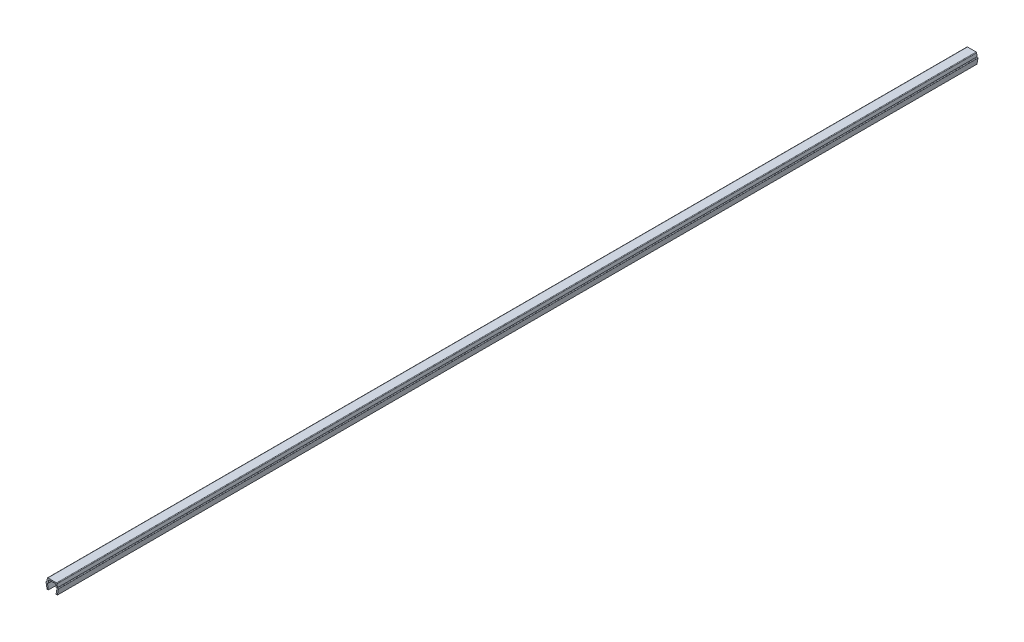
ISO-10303-21;
HEADER;
FILE_DESCRIPTION(('STEP AP214'),'2;1');
FILE_NAME('part.step','',(''),(''),'','','');
FILE_SCHEMA(('AUTOMOTIVE_DESIGN { 1 0 10303 214 1 1 1 1 }'));
ENDSEC;
DATA;
#1=APPLICATION_CONTEXT('core data for automotive mechanical design processes');
#2=APPLICATION_PROTOCOL_DEFINITION('international standard','automotive_design',2000,#1);
#3=PRODUCT_CONTEXT('',#1,'mechanical');
#4=PRODUCT('Part','Part','',(#3));
#5=PRODUCT_RELATED_PRODUCT_CATEGORY('part','',(#4));
#6=PRODUCT_DEFINITION_FORMATION('','',#4);
#7=PRODUCT_DEFINITION_CONTEXT('part definition',#1,'design');
#8=PRODUCT_DEFINITION('design','',#6,#7);
#9=PRODUCT_DEFINITION_SHAPE('','',#8);
#10=(LENGTH_UNIT() NAMED_UNIT(*) SI_UNIT(.MILLI.,.METRE.));
#11=(NAMED_UNIT(*) PLANE_ANGLE_UNIT() SI_UNIT($,.RADIAN.));
#12=(NAMED_UNIT(*) SI_UNIT($,.STERADIAN.) SOLID_ANGLE_UNIT());
#13=UNCERTAINTY_MEASURE_WITH_UNIT(LENGTH_MEASURE(1.E-05),#10,'distance_accuracy_value','');
#14=(GEOMETRIC_REPRESENTATION_CONTEXT(3) GLOBAL_UNCERTAINTY_ASSIGNED_CONTEXT((#13)) GLOBAL_UNIT_ASSIGNED_CONTEXT((#10,
#11,#12)) REPRESENTATION_CONTEXT('',''));
#15=CARTESIAN_POINT('',(0.,0.,0.));
#16=DIRECTION('',(0.,0.,1.));
#17=DIRECTION('',(1.,0.,0.));
#18=AXIS2_PLACEMENT_3D('',#15,#16,#17);
#19=CARTESIAN_POINT('',(-3.25000000000003,3.35000000000003,266.75));
#20=DIRECTION('',(0.,0.,-1.));
#21=DIRECTION('',(-1.,0.,0.));
#22=AXIS2_PLACEMENT_3D('',#19,#20,#21);
#23=CYLINDRICAL_SURFACE('',#22,0.349999999999972);
#24=DIRECTION('',(0.,0.,-1.));
#25=VECTOR('',#24,1.);
#26=CARTESIAN_POINT('',(-3.25,3.7,266.75));
#27=LINE('',#26,#25);
#28=CARTESIAN_POINT('',(-3.25,3.7,266.75));
#29=VERTEX_POINT('',#28);
#30=CARTESIAN_POINT('',(-3.25,3.7,-266.75));
#31=VERTEX_POINT('',#30);
#32=EDGE_CURVE('E211',#29,#31,#27,.T.);
#33=ORIENTED_EDGE('',*,*,#32,.T.);
#34=CARTESIAN_POINT('',(-3.25000000000003,3.35000000000003,-266.75));
#35=DIRECTION('',(0.,0.,1.));
#36=DIRECTION('',(1.,0.,0.));
#37=AXIS2_PLACEMENT_3D('',#34,#35,#36);
#38=CIRCLE('',#37,0.349999999999972);
#39=CARTESIAN_POINT('',(-3.6,3.35,-266.75));
#40=VERTEX_POINT('',#39);
#41=EDGE_CURVE('E205',#31,#40,#38,.T.);
#42=ORIENTED_EDGE('',*,*,#41,.T.);
#43=DIRECTION('',(0.,0.,-1.));
#44=VECTOR('',#43,1.);
#45=CARTESIAN_POINT('',(-3.6,3.35,266.75));
#46=LINE('',#45,#44);
#47=CARTESIAN_POINT('',(-3.6,3.35,266.75));
#48=VERTEX_POINT('',#47);
#49=EDGE_CURVE('E11',#48,#40,#46,.T.);
#50=ORIENTED_EDGE('',*,*,#49,.F.);
#51=CARTESIAN_POINT('',(-3.25000000000003,3.35000000000003,266.75));
#52=DIRECTION('',(0.,0.,1.));
#53=DIRECTION('',(1.,0.,0.));
#54=AXIS2_PLACEMENT_3D('',#51,#52,#53);
#55=CIRCLE('',#54,0.349999999999972);
#56=EDGE_CURVE('E277',#29,#48,#55,.T.);
#57=ORIENTED_EDGE('',*,*,#56,.F.);
#58=EDGE_LOOP('',(#33,#42,#50,#57));
#59=FACE_BOUND('',#58,.T.);
#60=ADVANCED_FACE('F33',(#59),#23,.T.);
#61=CARTESIAN_POINT('',(-3.6,3.35,266.75));
#62=DIRECTION('',(0.984336643247304,0.176299100283099,0.));
#63=DIRECTION('',(-0.176299100283099,0.984336643247304,0.));
#64=AXIS2_PLACEMENT_3D('',#61,#62,#63);
#65=PLANE('',#64);
#66=ORIENTED_EDGE('',*,*,#49,.T.);
#67=DIRECTION('',(0.176299100283099,-0.984336643247304,0.));
#68=VECTOR('',#67,1.);
#69=CARTESIAN_POINT('',(-3.6,3.35,-266.75));
#70=LINE('',#69,#68);
#71=CARTESIAN_POINT('',(-3.,0.,-266.75));
#72=VERTEX_POINT('',#71);
#73=EDGE_CURVE('E195',#40,#72,#70,.T.);
#74=ORIENTED_EDGE('',*,*,#73,.T.);
#75=DIRECTION('',(0.,0.,-1.));
#76=VECTOR('',#75,1.);
#77=CARTESIAN_POINT('',(-3.,0.,266.75));
#78=LINE('',#77,#76);
#79=CARTESIAN_POINT('',(-3.,0.,266.75));
#80=VERTEX_POINT('',#79);
#81=EDGE_CURVE('E40',#80,#72,#78,.T.);
#82=ORIENTED_EDGE('',*,*,#81,.F.);
#83=DIRECTION('',(0.176299100283099,-0.984336643247304,0.));
#84=VECTOR('',#83,1.);
#85=CARTESIAN_POINT('',(-3.6,3.35,266.75));
#86=LINE('',#85,#84);
#87=EDGE_CURVE('E196',#48,#80,#86,.T.);
#88=ORIENTED_EDGE('',*,*,#87,.F.);
#89=EDGE_LOOP('',(#66,#74,#82,#88));
#90=FACE_BOUND('',#89,.T.);
#91=ADVANCED_FACE('F193',(#90),#65,.F.);
#92=CARTESIAN_POINT('',(-3.,0.,266.75));
#93=DIRECTION('',(0.,1.,0.));
#94=DIRECTION('',(0.,0.,1.));
#95=AXIS2_PLACEMENT_3D('',#92,#93,#94);
#96=PLANE('',#95);
#97=ORIENTED_EDGE('',*,*,#81,.T.);
#98=DIRECTION('',(1.,0.,0.));
#99=VECTOR('',#98,1.);
#100=CARTESIAN_POINT('',(-3.,0.,-266.75));
#101=LINE('',#100,#99);
#102=CARTESIAN_POINT('',(-2.2,0.,-266.75));
#103=VERTEX_POINT('',#102);
#104=EDGE_CURVE('E209',#72,#103,#101,.T.);
#105=ORIENTED_EDGE('',*,*,#104,.T.);
#106=DIRECTION('',(0.,0.,-1.));
#107=VECTOR('',#106,1.);
#108=CARTESIAN_POINT('',(-2.2,0.,266.75));
#109=LINE('',#108,#107);
#110=CARTESIAN_POINT('',(-2.2,0.,266.75));
#111=VERTEX_POINT('',#110);
#112=EDGE_CURVE('E363',#111,#103,#109,.T.);
#113=ORIENTED_EDGE('',*,*,#112,.F.);
#114=DIRECTION('',(1.,0.,0.));
#115=VECTOR('',#114,1.);
#116=CARTESIAN_POINT('',(-3.,0.,266.75));
#117=LINE('',#116,#115);
#118=EDGE_CURVE('E280',#80,#111,#117,.T.);
#119=ORIENTED_EDGE('',*,*,#118,.F.);
#120=EDGE_LOOP('',(#97,#105,#113,#119));
#121=FACE_BOUND('',#120,.T.);
#122=ADVANCED_FACE('F366',(#121),#96,.F.);
#123=CARTESIAN_POINT('',(-2.2,0.,266.75));
#124=DIRECTION('',(-0.984336643247306,-0.176299100283088,0.));
#125=DIRECTION('',(0.176299100283088,-0.984336643247306,0.));
#126=AXIS2_PLACEMENT_3D('',#123,#124,#125);
#127=PLANE('',#126);
#128=ORIENTED_EDGE('',*,*,#112,.T.);
#129=DIRECTION('',(-0.176299100283088,0.984336643247306,0.));
#130=VECTOR('',#129,1.);
#131=CARTESIAN_POINT('',(-2.2,0.,-266.75));
#132=LINE('',#131,#130);
#133=CARTESIAN_POINT('',(-2.7352170713255,2.9882953149009,-266.75));
#134=VERTEX_POINT('',#133);
#135=EDGE_CURVE('E215',#103,#134,#132,.T.);
#136=ORIENTED_EDGE('',*,*,#135,.T.);
#137=DIRECTION('',(0.,0.,-1.));
#138=VECTOR('',#137,1.);
#139=CARTESIAN_POINT('',(-2.7352170713255,2.9882953149009,266.75));
#140=LINE('',#139,#138);
#141=CARTESIAN_POINT('',(-2.7352170713255,2.9882953149009,266.75));
#142=VERTEX_POINT('',#141);
#143=EDGE_CURVE('E361',#142,#134,#140,.T.);
#144=ORIENTED_EDGE('',*,*,#143,.F.);
#145=DIRECTION('',(-0.176299100283088,0.984336643247306,0.));
#146=VECTOR('',#145,1.);
#147=CARTESIAN_POINT('',(-2.2,0.,266.75));
#148=LINE('',#147,#146);
#149=EDGE_CURVE('E282',#111,#142,#148,.T.);
#150=ORIENTED_EDGE('',*,*,#149,.F.);
#151=EDGE_LOOP('',(#128,#136,#144,#150));
#152=FACE_BOUND('',#151,.T.);
#153=ADVANCED_FACE('F374',(#152),#127,.F.);
#154=CARTESIAN_POINT('',(-2.390699246189,3.05000000000004,266.75));
#155=DIRECTION('',(0.,0.,-1.));
#156=DIRECTION('',(-1.,0.,0.));
#157=AXIS2_PLACEMENT_3D('',#154,#155,#156);
#158=CYLINDRICAL_SURFACE('',#157,0.349999999999955);
#159=ORIENTED_EDGE('',*,*,#143,.T.);
#160=CARTESIAN_POINT('',(-2.390699246189,3.05000000000004,-266.75));
#161=DIRECTION('',(0.,0.,-1.));
#162=DIRECTION('',(-1.,0.,0.));
#163=AXIS2_PLACEMENT_3D('',#160,#161,#162);
#164=CIRCLE('',#163,0.349999999999955);
#165=CARTESIAN_POINT('',(-2.390699246189,3.4,-266.75));
#166=VERTEX_POINT('',#165);
#167=EDGE_CURVE('E218',#134,#166,#164,.T.);
#168=ORIENTED_EDGE('',*,*,#167,.T.);
#169=DIRECTION('',(0.,0.,-1.));
#170=VECTOR('',#169,1.);
#171=CARTESIAN_POINT('',(-2.390699246189,3.4,266.75));
#172=LINE('',#171,#170);
#173=CARTESIAN_POINT('',(-2.390699246189,3.4,266.75));
#174=VERTEX_POINT('',#173);
#175=EDGE_CURVE('E359',#174,#166,#172,.T.);
#176=ORIENTED_EDGE('',*,*,#175,.F.);
#177=CARTESIAN_POINT('',(-2.390699246189,3.05000000000004,266.75));
#178=DIRECTION('',(0.,0.,-1.));
#179=DIRECTION('',(-1.,0.,0.));
#180=AXIS2_PLACEMENT_3D('',#177,#178,#179);
#181=CIRCLE('',#180,0.349999999999955);
#182=EDGE_CURVE('E284',#142,#174,#181,.T.);
#183=ORIENTED_EDGE('',*,*,#182,.F.);
#184=EDGE_LOOP('',(#159,#168,#176,#183));
#185=FACE_BOUND('',#184,.T.);
#186=ADVANCED_FACE('F377',(#185),#158,.F.);
#187=CARTESIAN_POINT('',(-2.390699246189,3.4,266.75));
#188=DIRECTION('',(0.,1.,0.));
#189=DIRECTION('',(0.,0.,1.));
#190=AXIS2_PLACEMENT_3D('',#187,#188,#189);
#191=PLANE('',#190);
#192=ORIENTED_EDGE('',*,*,#175,.T.);
#193=DIRECTION('',(1.,0.,0.));
#194=VECTOR('',#193,1.);
#195=CARTESIAN_POINT('',(-2.390699246189,3.4,-266.75));
#196=LINE('',#195,#194);
#197=CARTESIAN_POINT('',(-2.2,3.4,-266.75));
#198=VERTEX_POINT('',#197);
#199=EDGE_CURVE('E221',#166,#198,#196,.T.);
#200=ORIENTED_EDGE('',*,*,#199,.T.);
#201=DIRECTION('',(0.,0.,-1.));
#202=VECTOR('',#201,1.);
#203=CARTESIAN_POINT('',(-2.2,3.4,266.75));
#204=LINE('',#203,#202);
#205=CARTESIAN_POINT('',(-2.2,3.4,266.75));
#206=VERTEX_POINT('',#205);
#207=EDGE_CURVE('E357',#206,#198,#204,.T.);
#208=ORIENTED_EDGE('',*,*,#207,.F.);
#209=DIRECTION('',(1.,0.,0.));
#210=VECTOR('',#209,1.);
#211=CARTESIAN_POINT('',(-2.390699246189,3.4,266.75));
#212=LINE('',#211,#210);
#213=EDGE_CURVE('E286',#174,#206,#212,.T.);
#214=ORIENTED_EDGE('',*,*,#213,.F.);
#215=EDGE_LOOP('',(#192,#200,#208,#214));
#216=FACE_BOUND('',#215,.T.);
#217=ADVANCED_FACE('F382',(#216),#191,.F.);
#218=CARTESIAN_POINT('',(-2.2,3.4,266.75));
#219=DIRECTION('',(-0.996194698091743,0.08715574274769,0.));
#220=DIRECTION('',(-0.08715574274769,-0.996194698091743,0.));
#221=AXIS2_PLACEMENT_3D('',#218,#219,#220);
#222=PLANE('',#221);
#223=ORIENTED_EDGE('',*,*,#207,.T.);
#224=DIRECTION('',(0.08715574274769,0.996194698091743,0.));
#225=VECTOR('',#224,1.);
#226=CARTESIAN_POINT('',(-2.2,3.4,-266.75));
#227=LINE('',#226,#225);
#228=CARTESIAN_POINT('',(-2.0704726390793,4.8805045099617,-266.75));
#229=VERTEX_POINT('',#228);
#230=EDGE_CURVE('E224',#198,#229,#227,.T.);
#231=ORIENTED_EDGE('',*,*,#230,.T.);
#232=DIRECTION('',(0.,0.,-1.));
#233=VECTOR('',#232,1.);
#234=CARTESIAN_POINT('',(-2.0704726390793,4.8805045099617,266.75));
#235=LINE('',#234,#233);
#236=CARTESIAN_POINT('',(-2.0704726390793,4.8805045099617,266.75));
#237=VERTEX_POINT('',#236);
#238=EDGE_CURVE('E355',#237,#229,#235,.T.);
#239=ORIENTED_EDGE('',*,*,#238,.F.);
#240=DIRECTION('',(0.08715574274769,0.996194698091743,0.));
#241=VECTOR('',#240,1.);
#242=CARTESIAN_POINT('',(-2.2,3.4,266.75));
#243=LINE('',#242,#241);
#244=EDGE_CURVE('E288',#206,#237,#243,.T.);
#245=ORIENTED_EDGE('',*,*,#244,.F.);
#246=EDGE_LOOP('',(#223,#231,#239,#245));
#247=FACE_BOUND('',#246,.T.);
#248=ADVANCED_FACE('F388',(#247),#222,.F.);
#249=CARTESIAN_POINT('',(-1.72180449474716,4.84999999999996,266.75));
#250=DIRECTION('',(0.,0.,-1.));
#251=DIRECTION('',(-1.,0.,0.));
#252=AXIS2_PLACEMENT_3D('',#249,#250,#251);
#253=CYLINDRICAL_SURFACE('',#252,0.350000000000036);
#254=ORIENTED_EDGE('',*,*,#238,.T.);
#255=CARTESIAN_POINT('',(-1.72180449474716,4.84999999999996,-266.75));
#256=DIRECTION('',(0.,0.,-1.));
#257=DIRECTION('',(-1.,0.,0.));
#258=AXIS2_PLACEMENT_3D('',#255,#256,#257);
#259=CIRCLE('',#258,0.350000000000036);
#260=CARTESIAN_POINT('',(-1.7218044947472,5.2,-266.75));
#261=VERTEX_POINT('',#260);
#262=EDGE_CURVE('E227',#229,#261,#259,.T.);
#263=ORIENTED_EDGE('',*,*,#262,.T.);
#264=DIRECTION('',(0.,0.,-1.));
#265=VECTOR('',#264,1.);
#266=CARTESIAN_POINT('',(-1.7218044947472,5.2,266.75));
#267=LINE('',#266,#265);
#268=CARTESIAN_POINT('',(-1.7218044947472,5.2,266.75));
#269=VERTEX_POINT('',#268);
#270=EDGE_CURVE('E353',#269,#261,#267,.T.);
#271=ORIENTED_EDGE('',*,*,#270,.F.);
#272=CARTESIAN_POINT('',(-1.72180449474716,4.84999999999996,266.75));
#273=DIRECTION('',(0.,0.,-1.));
#274=DIRECTION('',(-1.,0.,0.));
#275=AXIS2_PLACEMENT_3D('',#272,#273,#274);
#276=CIRCLE('',#275,0.350000000000036);
#277=EDGE_CURVE('E290',#237,#269,#276,.T.);
#278=ORIENTED_EDGE('',*,*,#277,.F.);
#279=EDGE_LOOP('',(#254,#263,#271,#278));
#280=FACE_BOUND('',#279,.T.);
#281=ADVANCED_FACE('F392',(#280),#253,.F.);
#282=CARTESIAN_POINT('',(-1.7218044947472,5.2,266.75));
#283=DIRECTION('',(0.,1.,0.));
#284=DIRECTION('',(0.,0.,1.));
#285=AXIS2_PLACEMENT_3D('',#282,#283,#284);
#286=PLANE('',#285);
#287=ORIENTED_EDGE('',*,*,#270,.T.);
#288=DIRECTION('',(1.,0.,0.));
#289=VECTOR('',#288,1.);
#290=CARTESIAN_POINT('',(-1.7218044947472,5.2,-266.75));
#291=LINE('',#290,#289);
#292=CARTESIAN_POINT('',(1.7218044947472,5.2,-266.75));
#293=VERTEX_POINT('',#292);
#294=EDGE_CURVE('E230',#261,#293,#291,.T.);
#295=ORIENTED_EDGE('',*,*,#294,.T.);
#296=DIRECTION('',(0.,0.,-1.));
#297=VECTOR('',#296,1.);
#298=CARTESIAN_POINT('',(1.7218044947472,5.2,266.75));
#299=LINE('',#298,#297);
#300=CARTESIAN_POINT('',(1.7218044947472,5.2,266.75));
#301=VERTEX_POINT('',#300);
#302=EDGE_CURVE('E351',#301,#293,#299,.T.);
#303=ORIENTED_EDGE('',*,*,#302,.F.);
#304=DIRECTION('',(1.,0.,0.));
#305=VECTOR('',#304,1.);
#306=CARTESIAN_POINT('',(-1.7218044947472,5.2,266.75));
#307=LINE('',#306,#305);
#308=EDGE_CURVE('E292',#269,#301,#307,.T.);
#309=ORIENTED_EDGE('',*,*,#308,.F.);
#310=EDGE_LOOP('',(#287,#295,#303,#309));
#311=FACE_BOUND('',#310,.T.);
#312=ADVANCED_FACE('F397',(#311),#286,.F.);
#313=CARTESIAN_POINT('',(1.72180449474716,4.84999999999996,266.75));
#314=DIRECTION('',(0.,0.,-1.));
#315=DIRECTION('',(-1.,0.,0.));
#316=AXIS2_PLACEMENT_3D('',#313,#314,#315);
#317=CYLINDRICAL_SURFACE('',#316,0.350000000000036);
#318=ORIENTED_EDGE('',*,*,#302,.T.);
#319=CARTESIAN_POINT('',(1.72180449474716,4.84999999999996,-266.75));
#320=DIRECTION('',(0.,0.,-1.));
#321=DIRECTION('',(-1.,0.,0.));
#322=AXIS2_PLACEMENT_3D('',#319,#320,#321);
#323=CIRCLE('',#322,0.350000000000036);
#324=CARTESIAN_POINT('',(2.0704726390793,4.8805045099617,-266.75));
#325=VERTEX_POINT('',#324);
#326=EDGE_CURVE('E233',#293,#325,#323,.T.);
#327=ORIENTED_EDGE('',*,*,#326,.T.);
#328=DIRECTION('',(0.,0.,-1.));
#329=VECTOR('',#328,1.);
#330=CARTESIAN_POINT('',(2.0704726390793,4.8805045099617,266.75));
#331=LINE('',#330,#329);
#332=CARTESIAN_POINT('',(2.0704726390793,4.8805045099617,266.75));
#333=VERTEX_POINT('',#332);
#334=EDGE_CURVE('E349',#333,#325,#331,.T.);
#335=ORIENTED_EDGE('',*,*,#334,.F.);
#336=CARTESIAN_POINT('',(1.72180449474716,4.84999999999996,266.75));
#337=DIRECTION('',(0.,0.,-1.));
#338=DIRECTION('',(-1.,0.,0.));
#339=AXIS2_PLACEMENT_3D('',#336,#337,#338);
#340=CIRCLE('',#339,0.350000000000036);
#341=EDGE_CURVE('E294',#301,#333,#340,.T.);
#342=ORIENTED_EDGE('',*,*,#341,.F.);
#343=EDGE_LOOP('',(#318,#327,#335,#342));
#344=FACE_BOUND('',#343,.T.);
#345=ADVANCED_FACE('F403',(#344),#317,.F.);
#346=CARTESIAN_POINT('',(2.0704726390793,4.8805045099617,266.75));
#347=DIRECTION('',(0.996194698091743,0.08715574274769,0.));
#348=DIRECTION('',(-0.08715574274769,0.996194698091743,0.));
#349=AXIS2_PLACEMENT_3D('',#346,#347,#348);
#350=PLANE('',#349);
#351=ORIENTED_EDGE('',*,*,#334,.T.);
#352=DIRECTION('',(0.08715574274769,-0.996194698091743,0.));
#353=VECTOR('',#352,1.);
#354=CARTESIAN_POINT('',(2.0704726390793,4.8805045099617,-266.75));
#355=LINE('',#354,#353);
#356=CARTESIAN_POINT('',(2.2,3.4,-266.75));
#357=VERTEX_POINT('',#356);
#358=EDGE_CURVE('E236',#325,#357,#355,.T.);
#359=ORIENTED_EDGE('',*,*,#358,.T.);
#360=DIRECTION('',(0.,0.,-1.));
#361=VECTOR('',#360,1.);
#362=CARTESIAN_POINT('',(2.2,3.4,266.75));
#363=LINE('',#362,#361);
#364=CARTESIAN_POINT('',(2.2,3.4,266.75));
#365=VERTEX_POINT('',#364);
#366=EDGE_CURVE('E347',#365,#357,#363,.T.);
#367=ORIENTED_EDGE('',*,*,#366,.F.);
#368=DIRECTION('',(0.08715574274769,-0.996194698091743,0.));
#369=VECTOR('',#368,1.);
#370=CARTESIAN_POINT('',(2.0704726390793,4.8805045099617,266.75));
#371=LINE('',#370,#369);
#372=EDGE_CURVE('E296',#333,#365,#371,.T.);
#373=ORIENTED_EDGE('',*,*,#372,.F.);
#374=EDGE_LOOP('',(#351,#359,#367,#373));
#375=FACE_BOUND('',#374,.T.);
#376=ADVANCED_FACE('F407',(#375),#350,.F.);
#377=CARTESIAN_POINT('',(2.2,3.4,266.75));
#378=DIRECTION('',(0.,1.,0.));
#379=DIRECTION('',(0.,0.,1.));
#380=AXIS2_PLACEMENT_3D('',#377,#378,#379);
#381=PLANE('',#380);
#382=ORIENTED_EDGE('',*,*,#366,.T.);
#383=DIRECTION('',(1.,0.,0.));
#384=VECTOR('',#383,1.);
#385=CARTESIAN_POINT('',(2.2,3.4,-266.75));
#386=LINE('',#385,#384);
#387=CARTESIAN_POINT('',(2.390699246189,3.4,-266.75));
#388=VERTEX_POINT('',#387);
#389=EDGE_CURVE('E239',#357,#388,#386,.T.);
#390=ORIENTED_EDGE('',*,*,#389,.T.);
#391=DIRECTION('',(0.,0.,-1.));
#392=VECTOR('',#391,1.);
#393=CARTESIAN_POINT('',(2.390699246189,3.4,266.75));
#394=LINE('',#393,#392);
#395=CARTESIAN_POINT('',(2.390699246189,3.4,266.75));
#396=VERTEX_POINT('',#395);
#397=EDGE_CURVE('E345',#396,#388,#394,.T.);
#398=ORIENTED_EDGE('',*,*,#397,.F.);
#399=DIRECTION('',(1.,0.,0.));
#400=VECTOR('',#399,1.);
#401=CARTESIAN_POINT('',(2.2,3.4,266.75));
#402=LINE('',#401,#400);
#403=EDGE_CURVE('E298',#365,#396,#402,.T.);
#404=ORIENTED_EDGE('',*,*,#403,.F.);
#405=EDGE_LOOP('',(#382,#390,#398,#404));
#406=FACE_BOUND('',#405,.T.);
#407=ADVANCED_FACE('F412',(#406),#381,.F.);
#408=CARTESIAN_POINT('',(2.390699246189,3.05000000000004,266.75));
#409=DIRECTION('',(0.,0.,-1.));
#410=DIRECTION('',(-1.,0.,0.));
#411=AXIS2_PLACEMENT_3D('',#408,#409,#410);
#412=CYLINDRICAL_SURFACE('',#411,0.349999999999955);
#413=ORIENTED_EDGE('',*,*,#397,.T.);
#414=CARTESIAN_POINT('',(2.390699246189,3.05000000000004,-266.75));
#415=DIRECTION('',(0.,0.,-1.));
#416=DIRECTION('',(-1.,0.,0.));
#417=AXIS2_PLACEMENT_3D('',#414,#415,#416);
#418=CIRCLE('',#417,0.349999999999955);
#419=CARTESIAN_POINT('',(2.7352170713255,2.9882953149009,-266.75));
#420=VERTEX_POINT('',#419);
#421=EDGE_CURVE('E242',#388,#420,#418,.T.);
#422=ORIENTED_EDGE('',*,*,#421,.T.);
#423=DIRECTION('',(0.,0.,-1.));
#424=VECTOR('',#423,1.);
#425=CARTESIAN_POINT('',(2.7352170713255,2.9882953149009,266.75));
#426=LINE('',#425,#424);
#427=CARTESIAN_POINT('',(2.7352170713255,2.9882953149009,266.75));
#428=VERTEX_POINT('',#427);
#429=EDGE_CURVE('E343',#428,#420,#426,.T.);
#430=ORIENTED_EDGE('',*,*,#429,.F.);
#431=CARTESIAN_POINT('',(2.390699246189,3.05000000000004,266.75));
#432=DIRECTION('',(0.,0.,-1.));
#433=DIRECTION('',(-1.,0.,0.));
#434=AXIS2_PLACEMENT_3D('',#431,#432,#433);
#435=CIRCLE('',#434,0.349999999999955);
#436=EDGE_CURVE('E300',#396,#428,#435,.T.);
#437=ORIENTED_EDGE('',*,*,#436,.F.);
#438=EDGE_LOOP('',(#413,#422,#430,#437));
#439=FACE_BOUND('',#438,.T.);
#440=ADVANCED_FACE('F418',(#439),#412,.F.);
#441=CARTESIAN_POINT('',(2.7352170713255,2.9882953149009,266.75));
#442=DIRECTION('',(0.984336643247306,-0.176299100283088,0.));
#443=DIRECTION('',(0.176299100283088,0.984336643247306,0.));
#444=AXIS2_PLACEMENT_3D('',#441,#442,#443);
#445=PLANE('',#444);
#446=ORIENTED_EDGE('',*,*,#429,.T.);
#447=DIRECTION('',(-0.176299100283088,-0.984336643247306,0.));
#448=VECTOR('',#447,1.);
#449=CARTESIAN_POINT('',(2.7352170713255,2.9882953149009,-266.75));
#450=LINE('',#449,#448);
#451=CARTESIAN_POINT('',(2.2,0.,-266.75));
#452=VERTEX_POINT('',#451);
#453=EDGE_CURVE('E245',#420,#452,#450,.T.);
#454=ORIENTED_EDGE('',*,*,#453,.T.);
#455=DIRECTION('',(0.,0.,-1.));
#456=VECTOR('',#455,1.);
#457=CARTESIAN_POINT('',(2.2,0.,266.75));
#458=LINE('',#457,#456);
#459=CARTESIAN_POINT('',(2.2,0.,266.75));
#460=VERTEX_POINT('',#459);
#461=EDGE_CURVE('E341',#460,#452,#458,.T.);
#462=ORIENTED_EDGE('',*,*,#461,.F.);
#463=DIRECTION('',(-0.176299100283088,-0.984336643247306,0.));
#464=VECTOR('',#463,1.);
#465=CARTESIAN_POINT('',(2.7352170713255,2.9882953149009,266.75));
#466=LINE('',#465,#464);
#467=EDGE_CURVE('E302',#428,#460,#466,.T.);
#468=ORIENTED_EDGE('',*,*,#467,.F.);
#469=EDGE_LOOP('',(#446,#454,#462,#468));
#470=FACE_BOUND('',#469,.T.);
#471=ADVANCED_FACE('F422',(#470),#445,.F.);
#472=CARTESIAN_POINT('',(2.2,0.,266.75));
#473=DIRECTION('',(0.,1.,0.));
#474=DIRECTION('',(0.,0.,1.));
#475=AXIS2_PLACEMENT_3D('',#472,#473,#474);
#476=PLANE('',#475);
#477=ORIENTED_EDGE('',*,*,#461,.T.);
#478=DIRECTION('',(1.,0.,0.));
#479=VECTOR('',#478,1.);
#480=CARTESIAN_POINT('',(2.2,0.,-266.75));
#481=LINE('',#480,#479);
#482=CARTESIAN_POINT('',(3.,0.,-266.75));
#483=VERTEX_POINT('',#482);
#484=EDGE_CURVE('E248',#452,#483,#481,.T.);
#485=ORIENTED_EDGE('',*,*,#484,.T.);
#486=DIRECTION('',(0.,0.,-1.));
#487=VECTOR('',#486,1.);
#488=CARTESIAN_POINT('',(3.,0.,266.75));
#489=LINE('',#488,#487);
#490=CARTESIAN_POINT('',(3.,0.,266.75));
#491=VERTEX_POINT('',#490);
#492=EDGE_CURVE('E339',#491,#483,#489,.T.);
#493=ORIENTED_EDGE('',*,*,#492,.F.);
#494=DIRECTION('',(1.,0.,0.));
#495=VECTOR('',#494,1.);
#496=CARTESIAN_POINT('',(2.2,0.,266.75));
#497=LINE('',#496,#495);
#498=EDGE_CURVE('E304',#460,#491,#497,.T.);
#499=ORIENTED_EDGE('',*,*,#498,.F.);
#500=EDGE_LOOP('',(#477,#485,#493,#499));
#501=FACE_BOUND('',#500,.T.);
#502=ADVANCED_FACE('F427',(#501),#476,.F.);
#503=CARTESIAN_POINT('',(3.,0.,266.75));
#504=DIRECTION('',(-0.984336643247304,0.176299100283099,0.));
#505=DIRECTION('',(-0.176299100283099,-0.984336643247304,0.));
#506=AXIS2_PLACEMENT_3D('',#503,#504,#505);
#507=PLANE('',#506);
#508=ORIENTED_EDGE('',*,*,#492,.T.);
#509=DIRECTION('',(0.176299100283099,0.984336643247304,0.));
#510=VECTOR('',#509,1.);
#511=CARTESIAN_POINT('',(3.,0.,-266.75));
#512=LINE('',#511,#510);
#513=CARTESIAN_POINT('',(3.6,3.35,-266.75));
#514=VERTEX_POINT('',#513);
#515=EDGE_CURVE('E251',#483,#514,#512,.T.);
#516=ORIENTED_EDGE('',*,*,#515,.T.);
#517=DIRECTION('',(0.,0.,-1.));
#518=VECTOR('',#517,1.);
#519=CARTESIAN_POINT('',(3.6,3.35,266.75));
#520=LINE('',#519,#518);
#521=CARTESIAN_POINT('',(3.6,3.35,266.75));
#522=VERTEX_POINT('',#521);
#523=EDGE_CURVE('E337',#522,#514,#520,.T.);
#524=ORIENTED_EDGE('',*,*,#523,.F.);
#525=DIRECTION('',(0.176299100283099,0.984336643247304,0.));
#526=VECTOR('',#525,1.);
#527=CARTESIAN_POINT('',(3.,0.,266.75));
#528=LINE('',#527,#526);
#529=EDGE_CURVE('E306',#491,#522,#528,.T.);
#530=ORIENTED_EDGE('',*,*,#529,.F.);
#531=EDGE_LOOP('',(#508,#516,#524,#530));
#532=FACE_BOUND('',#531,.T.);
#533=ADVANCED_FACE('F433',(#532),#507,.F.);
#534=CARTESIAN_POINT('',(3.25000000000003,3.35000000000003,266.75));
#535=DIRECTION('',(0.,0.,-1.));
#536=DIRECTION('',(-1.,0.,0.));
#537=AXIS2_PLACEMENT_3D('',#534,#535,#536);
#538=CYLINDRICAL_SURFACE('',#537,0.349999999999972);
#539=ORIENTED_EDGE('',*,*,#523,.T.);
#540=CARTESIAN_POINT('',(3.25000000000003,3.35000000000003,-266.75));
#541=DIRECTION('',(0.,0.,1.));
#542=DIRECTION('',(1.,0.,0.));
#543=AXIS2_PLACEMENT_3D('',#540,#541,#542);
#544=CIRCLE('',#543,0.349999999999972);
#545=CARTESIAN_POINT('',(3.25,3.7,-266.75));
#546=VERTEX_POINT('',#545);
#547=EDGE_CURVE('E254',#514,#546,#544,.T.);
#548=ORIENTED_EDGE('',*,*,#547,.T.);
#549=DIRECTION('',(0.,0.,-1.));
#550=VECTOR('',#549,1.);
#551=CARTESIAN_POINT('',(3.25,3.7,266.75));
#552=LINE('',#551,#550);
#553=CARTESIAN_POINT('',(3.25,3.7,266.75));
#554=VERTEX_POINT('',#553);
#555=EDGE_CURVE('E335',#554,#546,#552,.T.);
#556=ORIENTED_EDGE('',*,*,#555,.F.);
#557=CARTESIAN_POINT('',(3.25000000000003,3.35000000000003,266.75));
#558=DIRECTION('',(0.,0.,1.));
#559=DIRECTION('',(1.,0.,0.));
#560=AXIS2_PLACEMENT_3D('',#557,#558,#559);
#561=CIRCLE('',#560,0.349999999999972);
#562=EDGE_CURVE('E308',#522,#554,#561,.T.);
#563=ORIENTED_EDGE('',*,*,#562,.F.);
#564=EDGE_LOOP('',(#539,#548,#556,#563));
#565=FACE_BOUND('',#564,.T.);
#566=ADVANCED_FACE('F437',(#565),#538,.T.);
#567=CARTESIAN_POINT('',(3.25,3.7,266.75));
#568=DIRECTION('',(0.,-1.,0.));
#569=DIRECTION('',(0.,0.,-1.));
#570=AXIS2_PLACEMENT_3D('',#567,#568,#569);
#571=PLANE('',#570);
#572=ORIENTED_EDGE('',*,*,#555,.T.);
#573=DIRECTION('',(-1.,0.,0.));
#574=VECTOR('',#573,1.);
#575=CARTESIAN_POINT('',(3.25,3.7,-266.75));
#576=LINE('',#575,#574);
#577=CARTESIAN_POINT('',(3.,3.7,-266.75));
#578=VERTEX_POINT('',#577);
#579=EDGE_CURVE('E257',#546,#578,#576,.T.);
#580=ORIENTED_EDGE('',*,*,#579,.T.);
#581=DIRECTION('',(0.,0.,-1.));
#582=VECTOR('',#581,1.);
#583=CARTESIAN_POINT('',(3.,3.7,266.75));
#584=LINE('',#583,#582);
#585=CARTESIAN_POINT('',(3.,3.7,266.75));
#586=VERTEX_POINT('',#585);
#587=EDGE_CURVE('E333',#586,#578,#584,.T.);
#588=ORIENTED_EDGE('',*,*,#587,.F.);
#589=DIRECTION('',(-1.,0.,0.));
#590=VECTOR('',#589,1.);
#591=CARTESIAN_POINT('',(3.25,3.7,266.75));
#592=LINE('',#591,#590);
#593=EDGE_CURVE('E310',#554,#586,#592,.T.);
#594=ORIENTED_EDGE('',*,*,#593,.F.);
#595=EDGE_LOOP('',(#572,#580,#588,#594));
#596=FACE_BOUND('',#595,.T.);
#597=ADVANCED_FACE('F442',(#596),#571,.F.);
#598=CARTESIAN_POINT('',(3.,3.7,266.75));
#599=DIRECTION('',(-0.996194698091747,-0.0871557427476467,0.));
#600=DIRECTION('',(0.0871557427476467,-0.996194698091747,0.));
#601=AXIS2_PLACEMENT_3D('',#598,#599,#600);
#602=PLANE('',#601);
#603=ORIENTED_EDGE('',*,*,#587,.T.);
#604=DIRECTION('',(-0.0871557427476467,0.996194698091747,0.));
#605=VECTOR('',#604,1.);
#606=CARTESIAN_POINT('',(3.,3.7,-266.75));
#607=LINE('',#606,#605);
#608=CARTESIAN_POINT('',(2.835477173669,5.5805045099617,-266.75));
#609=VERTEX_POINT('',#608);
#610=EDGE_CURVE('E260',#578,#609,#607,.T.);
#611=ORIENTED_EDGE('',*,*,#610,.T.);
#612=DIRECTION('',(0.,0.,-1.));
#613=VECTOR('',#612,1.);
#614=CARTESIAN_POINT('',(2.835477173669,5.5805045099617,266.75));
#615=LINE('',#614,#613);
#616=CARTESIAN_POINT('',(2.835477173669,5.5805045099617,266.75));
#617=VERTEX_POINT('',#616);
#618=EDGE_CURVE('E331',#617,#609,#615,.T.);
#619=ORIENTED_EDGE('',*,*,#618,.F.);
#620=DIRECTION('',(-0.0871557427476467,0.996194698091747,0.));
#621=VECTOR('',#620,1.);
#622=CARTESIAN_POINT('',(3.,3.7,266.75));
#623=LINE('',#622,#621);
#624=EDGE_CURVE('E312',#586,#617,#623,.T.);
#625=ORIENTED_EDGE('',*,*,#624,.F.);
#626=EDGE_LOOP('',(#603,#611,#619,#625));
#627=FACE_BOUND('',#626,.T.);
#628=ADVANCED_FACE('F448',(#627),#602,.F.);
#629=CARTESIAN_POINT('',(2.48680902933686,5.54999999999996,266.75));
#630=DIRECTION('',(0.,0.,-1.));
#631=DIRECTION('',(-1.,0.,0.));
#632=AXIS2_PLACEMENT_3D('',#629,#630,#631);
#633=CYLINDRICAL_SURFACE('',#632,0.350000000000036);
#634=ORIENTED_EDGE('',*,*,#618,.T.);
#635=CARTESIAN_POINT('',(2.48680902933686,5.54999999999996,-266.75));
#636=DIRECTION('',(0.,0.,1.));
#637=DIRECTION('',(1.,0.,0.));
#638=AXIS2_PLACEMENT_3D('',#635,#636,#637);
#639=CIRCLE('',#638,0.350000000000036);
#640=CARTESIAN_POINT('',(2.4868090293369,5.9,-266.75));
#641=VERTEX_POINT('',#640);
#642=EDGE_CURVE('E263',#609,#641,#639,.T.);
#643=ORIENTED_EDGE('',*,*,#642,.T.);
#644=DIRECTION('',(0.,0.,-1.));
#645=VECTOR('',#644,1.);
#646=CARTESIAN_POINT('',(2.4868090293369,5.9,266.75));
#647=LINE('',#646,#645);
#648=CARTESIAN_POINT('',(2.4868090293369,5.9,266.75));
#649=VERTEX_POINT('',#648);
#650=EDGE_CURVE('E329',#649,#641,#647,.T.);
#651=ORIENTED_EDGE('',*,*,#650,.F.);
#652=CARTESIAN_POINT('',(2.48680902933686,5.54999999999996,266.75));
#653=DIRECTION('',(0.,0.,1.));
#654=DIRECTION('',(1.,0.,0.));
#655=AXIS2_PLACEMENT_3D('',#652,#653,#654);
#656=CIRCLE('',#655,0.350000000000036);
#657=EDGE_CURVE('E314',#617,#649,#656,.T.);
#658=ORIENTED_EDGE('',*,*,#657,.F.);
#659=EDGE_LOOP('',(#634,#643,#651,#658));
#660=FACE_BOUND('',#659,.T.);
#661=ADVANCED_FACE('F452',(#660),#633,.T.);
#662=CARTESIAN_POINT('',(2.4868090293369,5.9,266.75));
#663=DIRECTION('',(0.,-1.,0.));
#664=DIRECTION('',(0.,0.,-1.));
#665=AXIS2_PLACEMENT_3D('',#662,#663,#664);
#666=PLANE('',#665);
#667=ORIENTED_EDGE('',*,*,#650,.T.);
#668=DIRECTION('',(-1.,0.,0.));
#669=VECTOR('',#668,1.);
#670=CARTESIAN_POINT('',(2.4868090293369,5.9,-266.75));
#671=LINE('',#670,#669);
#672=CARTESIAN_POINT('',(-2.4868090293369,5.9,-266.75));
#673=VERTEX_POINT('',#672);
#674=EDGE_CURVE('E266',#641,#673,#671,.T.);
#675=ORIENTED_EDGE('',*,*,#674,.T.);
#676=DIRECTION('',(0.,0.,-1.));
#677=VECTOR('',#676,1.);
#678=CARTESIAN_POINT('',(-2.4868090293369,5.9,266.75));
#679=LINE('',#678,#677);
#680=CARTESIAN_POINT('',(-2.4868090293369,5.9,266.75));
#681=VERTEX_POINT('',#680);
#682=EDGE_CURVE('E327',#681,#673,#679,.T.);
#683=ORIENTED_EDGE('',*,*,#682,.F.);
#684=DIRECTION('',(-1.,0.,0.));
#685=VECTOR('',#684,1.);
#686=CARTESIAN_POINT('',(2.4868090293369,5.9,266.75));
#687=LINE('',#686,#685);
#688=EDGE_CURVE('E316',#649,#681,#687,.T.);
#689=ORIENTED_EDGE('',*,*,#688,.F.);
#690=EDGE_LOOP('',(#667,#675,#683,#689));
#691=FACE_BOUND('',#690,.T.);
#692=ADVANCED_FACE('F457',(#691),#666,.F.);
#693=CARTESIAN_POINT('',(-2.48680902933686,5.54999999999996,266.75));
#694=DIRECTION('',(0.,0.,-1.));
#695=DIRECTION('',(-1.,0.,0.));
#696=AXIS2_PLACEMENT_3D('',#693,#694,#695);
#697=CYLINDRICAL_SURFACE('',#696,0.350000000000036);
#698=ORIENTED_EDGE('',*,*,#682,.T.);
#699=CARTESIAN_POINT('',(-2.48680902933686,5.54999999999996,-266.75));
#700=DIRECTION('',(0.,0.,1.));
#701=DIRECTION('',(1.,0.,0.));
#702=AXIS2_PLACEMENT_3D('',#699,#700,#701);
#703=CIRCLE('',#702,0.350000000000036);
#704=CARTESIAN_POINT('',(-2.835477173669,5.5805045099617,-266.75));
#705=VERTEX_POINT('',#704);
#706=EDGE_CURVE('E269',#673,#705,#703,.T.);
#707=ORIENTED_EDGE('',*,*,#706,.T.);
#708=DIRECTION('',(0.,0.,-1.));
#709=VECTOR('',#708,1.);
#710=CARTESIAN_POINT('',(-2.835477173669,5.5805045099617,266.75));
#711=LINE('',#710,#709);
#712=CARTESIAN_POINT('',(-2.835477173669,5.5805045099617,266.75));
#713=VERTEX_POINT('',#712);
#714=EDGE_CURVE('E325',#713,#705,#711,.T.);
#715=ORIENTED_EDGE('',*,*,#714,.F.);
#716=CARTESIAN_POINT('',(-2.48680902933686,5.54999999999996,266.75));
#717=DIRECTION('',(0.,0.,1.));
#718=DIRECTION('',(1.,0.,0.));
#719=AXIS2_PLACEMENT_3D('',#716,#717,#718);
#720=CIRCLE('',#719,0.350000000000036);
#721=EDGE_CURVE('E318',#681,#713,#720,.T.);
#722=ORIENTED_EDGE('',*,*,#721,.F.);
#723=EDGE_LOOP('',(#698,#707,#715,#722));
#724=FACE_BOUND('',#723,.T.);
#725=ADVANCED_FACE('F461',(#724),#697,.T.);
#726=CARTESIAN_POINT('',(-2.835477173669,5.5805045099617,266.75));
#727=DIRECTION('',(0.996194698091747,-0.0871557427476467,0.));
#728=DIRECTION('',(0.0871557427476467,0.996194698091747,0.));
#729=AXIS2_PLACEMENT_3D('',#726,#727,#728);
#730=PLANE('',#729);
#731=ORIENTED_EDGE('',*,*,#714,.T.);
#732=DIRECTION('',(-0.0871557427476467,-0.996194698091747,0.));
#733=VECTOR('',#732,1.);
#734=CARTESIAN_POINT('',(-2.835477173669,5.5805045099617,-266.75));
#735=LINE('',#734,#733);
#736=CARTESIAN_POINT('',(-3.,3.7,-266.75));
#737=VERTEX_POINT('',#736);
#738=EDGE_CURVE('E272',#705,#737,#735,.T.);
#739=ORIENTED_EDGE('',*,*,#738,.T.);
#740=DIRECTION('',(0.,0.,-1.));
#741=VECTOR('',#740,1.);
#742=CARTESIAN_POINT('',(-3.,3.7,266.75));
#743=LINE('',#742,#741);
#744=CARTESIAN_POINT('',(-3.,3.7,266.75));
#745=VERTEX_POINT('',#744);
#746=EDGE_CURVE('E323',#745,#737,#743,.T.);
#747=ORIENTED_EDGE('',*,*,#746,.F.);
#748=DIRECTION('',(-0.0871557427476467,-0.996194698091747,0.));
#749=VECTOR('',#748,1.);
#750=CARTESIAN_POINT('',(-2.835477173669,5.5805045099617,266.75));
#751=LINE('',#750,#749);
#752=EDGE_CURVE('E52',#713,#745,#751,.T.);
#753=ORIENTED_EDGE('',*,*,#752,.F.);
#754=EDGE_LOOP('',(#731,#739,#747,#753));
#755=FACE_BOUND('',#754,.T.);
#756=ADVANCED_FACE('F465',(#755),#730,.F.);
#757=CARTESIAN_POINT('',(-3.,3.7,266.75));
#758=DIRECTION('',(0.,-1.,0.));
#759=DIRECTION('',(0.,0.,-1.));
#760=AXIS2_PLACEMENT_3D('',#757,#758,#759);
#761=PLANE('',#760);
#762=ORIENTED_EDGE('',*,*,#746,.T.);
#763=DIRECTION('',(-1.,0.,0.));
#764=VECTOR('',#763,1.);
#765=CARTESIAN_POINT('',(-3.,3.7,-266.75));
#766=LINE('',#765,#764);
#767=EDGE_CURVE('E275',#737,#31,#766,.T.);
#768=ORIENTED_EDGE('',*,*,#767,.T.);
#769=ORIENTED_EDGE('',*,*,#32,.F.);
#770=DIRECTION('',(-1.,0.,0.));
#771=VECTOR('',#770,1.);
#772=CARTESIAN_POINT('',(-3.,3.7,266.75));
#773=LINE('',#772,#771);
#774=EDGE_CURVE('E47',#745,#29,#773,.T.);
#775=ORIENTED_EDGE('',*,*,#774,.F.);
#776=EDGE_LOOP('',(#762,#768,#769,#775));
#777=FACE_BOUND('',#776,.T.);
#778=ADVANCED_FACE('F467',(#777),#761,.F.);
#779=CARTESIAN_POINT('',(-3.25000000000003,3.35000000000003,266.75));
#780=DIRECTION('',(0.,0.,1.));
#781=DIRECTION('',(1.,0.,0.));
#782=AXIS2_PLACEMENT_3D('',#779,#780,#781);
#783=PLANE('',#782);
#784=ORIENTED_EDGE('',*,*,#56,.T.);
#785=ORIENTED_EDGE('',*,*,#87,.T.);
#786=ORIENTED_EDGE('',*,*,#118,.T.);
#787=ORIENTED_EDGE('',*,*,#149,.T.);
#788=ORIENTED_EDGE('',*,*,#182,.T.);
#789=ORIENTED_EDGE('',*,*,#213,.T.);
#790=ORIENTED_EDGE('',*,*,#244,.T.);
#791=ORIENTED_EDGE('',*,*,#277,.T.);
#792=ORIENTED_EDGE('',*,*,#308,.T.);
#793=ORIENTED_EDGE('',*,*,#341,.T.);
#794=ORIENTED_EDGE('',*,*,#372,.T.);
#795=ORIENTED_EDGE('',*,*,#403,.T.);
#796=ORIENTED_EDGE('',*,*,#436,.T.);
#797=ORIENTED_EDGE('',*,*,#467,.T.);
#798=ORIENTED_EDGE('',*,*,#498,.T.);
#799=ORIENTED_EDGE('',*,*,#529,.T.);
#800=ORIENTED_EDGE('',*,*,#562,.T.);
#801=ORIENTED_EDGE('',*,*,#593,.T.);
#802=ORIENTED_EDGE('',*,*,#624,.T.);
#803=ORIENTED_EDGE('',*,*,#657,.T.);
#804=ORIENTED_EDGE('',*,*,#688,.T.);
#805=ORIENTED_EDGE('',*,*,#721,.T.);
#806=ORIENTED_EDGE('',*,*,#752,.T.);
#807=ORIENTED_EDGE('',*,*,#774,.T.);
#808=EDGE_LOOP('',(#784,#785,#786,#787,#788,#789,#790,#791,#792,#793,#794,#795,#796,#797,#798,
#799,#800,#801,#802,#803,#804,#805,#806,#807));
#809=FACE_BOUND('',#808,.T.);
#810=ADVANCED_FACE('F369',(#809),#783,.T.);
#811=CARTESIAN_POINT('',(-3.25000000000003,3.35000000000003,-266.75));
#812=DIRECTION('',(0.,0.,1.));
#813=DIRECTION('',(1.,0.,0.));
#814=AXIS2_PLACEMENT_3D('',#811,#812,#813);
#815=PLANE('',#814);
#816=ORIENTED_EDGE('',*,*,#41,.F.);
#817=ORIENTED_EDGE('',*,*,#767,.F.);
#818=ORIENTED_EDGE('',*,*,#738,.F.);
#819=ORIENTED_EDGE('',*,*,#706,.F.);
#820=ORIENTED_EDGE('',*,*,#674,.F.);
#821=ORIENTED_EDGE('',*,*,#642,.F.);
#822=ORIENTED_EDGE('',*,*,#610,.F.);
#823=ORIENTED_EDGE('',*,*,#579,.F.);
#824=ORIENTED_EDGE('',*,*,#547,.F.);
#825=ORIENTED_EDGE('',*,*,#515,.F.);
#826=ORIENTED_EDGE('',*,*,#484,.F.);
#827=ORIENTED_EDGE('',*,*,#453,.F.);
#828=ORIENTED_EDGE('',*,*,#421,.F.);
#829=ORIENTED_EDGE('',*,*,#389,.F.);
#830=ORIENTED_EDGE('',*,*,#358,.F.);
#831=ORIENTED_EDGE('',*,*,#326,.F.);
#832=ORIENTED_EDGE('',*,*,#294,.F.);
#833=ORIENTED_EDGE('',*,*,#262,.F.);
#834=ORIENTED_EDGE('',*,*,#230,.F.);
#835=ORIENTED_EDGE('',*,*,#199,.F.);
#836=ORIENTED_EDGE('',*,*,#167,.F.);
#837=ORIENTED_EDGE('',*,*,#135,.F.);
#838=ORIENTED_EDGE('',*,*,#104,.F.);
#839=ORIENTED_EDGE('',*,*,#73,.F.);
#840=EDGE_LOOP('',(#816,#817,#818,#819,#820,#821,#822,#823,#824,#825,#826,#827,#828,#829,#830,
#831,#832,#833,#834,#835,#836,#837,#838,#839));
#841=FACE_BOUND('',#840,.T.);
#842=ADVANCED_FACE('F203',(#841),#815,.F.);
#843=CLOSED_SHELL('',(#60,#91,#122,#153,#186,#217,#248,#281,#312,#345,#376,#407,#440,#471,#502,
#533,#566,#597,#628,#661,#692,#725,#756,#778,#810,#842));
#844=MANIFOLD_SOLID_BREP('B2',#843);
#845=ADVANCED_BREP_SHAPE_REPRESENTATION('',(#18,#844),#14);
#846=SHAPE_DEFINITION_REPRESENTATION(#9,#845);
ENDSEC;
END-ISO-10303-21;
